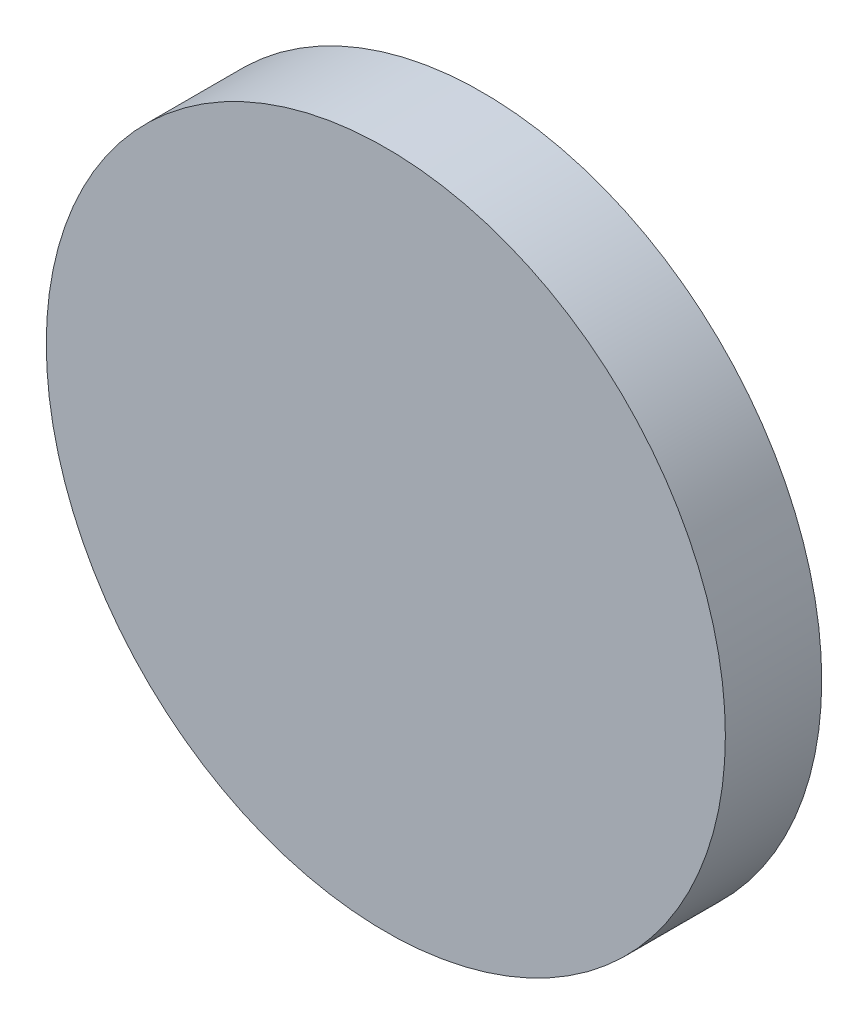
ISO-10303-21;
HEADER;
FILE_DESCRIPTION(('STEP AP214'),'2;1');
FILE_NAME('part.step','',(''),(''),'','','');
FILE_SCHEMA(('AUTOMOTIVE_DESIGN { 1 0 10303 214 1 1 1 1 }'));
ENDSEC;
DATA;
#1=APPLICATION_CONTEXT('core data for automotive mechanical design processes');
#2=APPLICATION_PROTOCOL_DEFINITION('international standard','automotive_design',2000,#1);
#3=PRODUCT_CONTEXT('',#1,'mechanical');
#4=PRODUCT('Part','Part','',(#3));
#5=PRODUCT_RELATED_PRODUCT_CATEGORY('part','',(#4));
#6=PRODUCT_DEFINITION_FORMATION('','',#4);
#7=PRODUCT_DEFINITION_CONTEXT('part definition',#1,'design');
#8=PRODUCT_DEFINITION('design','',#6,#7);
#9=PRODUCT_DEFINITION_SHAPE('','',#8);
#10=(LENGTH_UNIT() NAMED_UNIT(*) SI_UNIT(.MILLI.,.METRE.));
#11=(NAMED_UNIT(*) PLANE_ANGLE_UNIT() SI_UNIT($,.RADIAN.));
#12=(NAMED_UNIT(*) SI_UNIT($,.STERADIAN.) SOLID_ANGLE_UNIT());
#13=UNCERTAINTY_MEASURE_WITH_UNIT(LENGTH_MEASURE(1.E-05),#10,'distance_accuracy_value','');
#14=(GEOMETRIC_REPRESENTATION_CONTEXT(3) GLOBAL_UNCERTAINTY_ASSIGNED_CONTEXT((#13)) GLOBAL_UNIT_ASSIGNED_CONTEXT((#10,
#11,#12)) REPRESENTATION_CONTEXT('',''));
#15=CARTESIAN_POINT('',(0.,0.,0.));
#16=DIRECTION('',(0.,0.,1.));
#17=DIRECTION('',(1.,0.,0.));
#18=AXIS2_PLACEMENT_3D('',#15,#16,#17);
#19=CARTESIAN_POINT('',(0.,0.,2.59695236331892));
#20=DIRECTION('',(0.,0.,-1.));
#21=DIRECTION('',(-1.,0.,0.));
#22=AXIS2_PLACEMENT_3D('',#19,#20,#21);
#23=PLANE('',#22);
#24=CARTESIAN_POINT('',(0.,0.,2.59695236331892));
#25=DIRECTION('',(0.,0.,1.));
#26=DIRECTION('',(1.,0.,0.));
#27=AXIS2_PLACEMENT_3D('',#24,#25,#26);
#28=CIRCLE('',#27,136.52);
#29=CARTESIAN_POINT('',(136.52,0.,2.59695236331892));
#30=VERTEX_POINT('',#29);
#31=EDGE_CURVE('E10',#30,#30,#28,.T.);
#32=ORIENTED_EDGE('',*,*,#31,.T.);
#33=EDGE_LOOP('',(#32));
#34=FACE_BOUND('',#33,.T.);
#35=ADVANCED_FACE('F39',(#34),#23,.F.);
#36=CARTESIAN_POINT('',(0.,0.,53.8354538311833));
#37=DIRECTION('',(0.,0.,1.));
#38=DIRECTION('',(1.,0.,0.));
#39=AXIS2_PLACEMENT_3D('',#36,#37,#38);
#40=CYLINDRICAL_SURFACE('',#39,136.52);
#41=ORIENTED_EDGE('',*,*,#31,.F.);
#42=EDGE_LOOP('',(#41));
#43=FACE_BOUND('',#42,.T.);
#44=CARTESIAN_POINT('',(0.,0.,-36.1451883377251));
#45=DIRECTION('',(0.,0.,1.));
#46=DIRECTION('',(1.,0.,0.));
#47=AXIS2_PLACEMENT_3D('',#44,#45,#46);
#48=CIRCLE('',#47,136.52);
#49=CARTESIAN_POINT('',(136.52,0.,-36.1451883377251));
#50=VERTEX_POINT('',#49);
#51=EDGE_CURVE('E46',#50,#50,#48,.T.);
#52=ORIENTED_EDGE('',*,*,#51,.T.);
#53=EDGE_LOOP('',(#52));
#54=FACE_BOUND('',#53,.T.);
#55=ADVANCED_FACE('F107',(#43,#54),#40,.T.);
#56=CARTESIAN_POINT('',(0.,136.52,-36.1451883377251));
#57=DIRECTION('',(0.,0.,1.));
#58=DIRECTION('',(1.,0.,0.));
#59=AXIS2_PLACEMENT_3D('',#56,#57,#58);
#60=PLANE('',#59);
#61=ORIENTED_EDGE('',*,*,#51,.F.);
#62=EDGE_LOOP('',(#61));
#63=FACE_BOUND('',#62,.T.);
#64=CARTESIAN_POINT('',(0.,0.,-36.1451883377251));
#65=DIRECTION('',(0.,0.,1.));
#66=DIRECTION('',(1.,0.,0.));
#67=AXIS2_PLACEMENT_3D('',#64,#65,#66);
#68=CIRCLE('',#67,133.52);
#69=CARTESIAN_POINT('',(133.52,0.,-36.1451883377251));
#70=VERTEX_POINT('',#69);
#71=EDGE_CURVE('E51',#70,#70,#68,.T.);
#72=ORIENTED_EDGE('',*,*,#71,.T.);
#73=EDGE_LOOP('',(#72));
#74=FACE_BOUND('',#73,.T.);
#75=ADVANCED_FACE('F111',(#63,#74),#60,.F.);
#76=CARTESIAN_POINT('',(0.,0.,53.8354538311833));
#77=DIRECTION('',(0.,0.,1.));
#78=DIRECTION('',(1.,0.,0.));
#79=AXIS2_PLACEMENT_3D('',#76,#77,#78);
#80=CYLINDRICAL_SURFACE('',#79,133.52);
#81=ORIENTED_EDGE('',*,*,#71,.F.);
#82=EDGE_LOOP('',(#81));
#83=FACE_BOUND('',#82,.T.);
#84=CARTESIAN_POINT('',(0.,0.,-1.14518833772513));
#85=DIRECTION('',(0.,0.,1.));
#86=DIRECTION('',(1.,0.,0.));
#87=AXIS2_PLACEMENT_3D('',#84,#85,#86);
#88=CIRCLE('',#87,133.52);
#89=CARTESIAN_POINT('',(133.52,0.,-1.14518833772513));
#90=VERTEX_POINT('',#89);
#91=EDGE_CURVE('E56',#90,#90,#88,.T.);
#92=ORIENTED_EDGE('',*,*,#91,.T.);
#93=EDGE_LOOP('',(#92));
#94=FACE_BOUND('',#93,.T.);
#95=ADVANCED_FACE('F116',(#83,#94),#80,.F.);
#96=CARTESIAN_POINT('',(0.,133.52,-1.14518833772513));
#97=DIRECTION('',(0.,0.,1.));
#98=DIRECTION('',(1.,0.,0.));
#99=AXIS2_PLACEMENT_3D('',#96,#97,#98);
#100=PLANE('',#99);
#101=ORIENTED_EDGE('',*,*,#91,.F.);
#102=EDGE_LOOP('',(#101));
#103=FACE_BOUND('',#102,.T.);
#104=CARTESIAN_POINT('',(0.,0.,-1.14518833772514));
#105=DIRECTION('',(0.,0.,1.));
#106=DIRECTION('',(1.,0.,0.));
#107=AXIS2_PLACEMENT_3D('',#104,#105,#106);
#108=CIRCLE('',#107,98.);
#109=CARTESIAN_POINT('',(98.,0.,-1.14518833772514));
#110=VERTEX_POINT('',#109);
#111=EDGE_CURVE('E62',#110,#110,#108,.T.);
#112=ORIENTED_EDGE('',*,*,#111,.T.);
#113=EDGE_LOOP('',(#112));
#114=FACE_BOUND('',#113,.T.);
#115=ADVANCED_FACE('F122',(#103,#114),#100,.F.);
#116=CARTESIAN_POINT('',(0.,0.,53.8354538311833));
#117=DIRECTION('',(0.,0.,1.));
#118=DIRECTION('',(1.,0.,0.));
#119=AXIS2_PLACEMENT_3D('',#116,#117,#118);
#120=CYLINDRICAL_SURFACE('',#119,98.);
#121=ORIENTED_EDGE('',*,*,#111,.F.);
#122=EDGE_LOOP('',(#121));
#123=FACE_BOUND('',#122,.T.);
#124=CARTESIAN_POINT('',(0.,0.,-36.1451883377251));
#125=DIRECTION('',(0.,0.,1.));
#126=DIRECTION('',(1.,0.,0.));
#127=AXIS2_PLACEMENT_3D('',#124,#125,#126);
#128=CIRCLE('',#127,98.);
#129=CARTESIAN_POINT('',(98.,0.,-36.1451883377251));
#130=VERTEX_POINT('',#129);
#131=EDGE_CURVE('E66',#130,#130,#128,.T.);
#132=ORIENTED_EDGE('',*,*,#131,.T.);
#133=EDGE_LOOP('',(#132));
#134=FACE_BOUND('',#133,.T.);
#135=ADVANCED_FACE('F126',(#123,#134),#120,.T.);
#136=CARTESIAN_POINT('',(0.,98.,-36.1451883377251));
#137=DIRECTION('',(0.,0.,1.));
#138=DIRECTION('',(1.,0.,0.));
#139=AXIS2_PLACEMENT_3D('',#136,#137,#138);
#140=PLANE('',#139);
#141=ORIENTED_EDGE('',*,*,#131,.F.);
#142=EDGE_LOOP('',(#141));
#143=FACE_BOUND('',#142,.T.);
#144=CARTESIAN_POINT('',(0.,0.,-36.1451883377251));
#145=DIRECTION('',(0.,0.,1.));
#146=DIRECTION('',(1.,0.,0.));
#147=AXIS2_PLACEMENT_3D('',#144,#145,#146);
#148=CIRCLE('',#147,95.);
#149=CARTESIAN_POINT('',(95.,0.,-36.1451883377251));
#150=VERTEX_POINT('',#149);
#151=EDGE_CURVE('E70',#150,#150,#148,.T.);
#152=ORIENTED_EDGE('',*,*,#151,.T.);
#153=EDGE_LOOP('',(#152));
#154=FACE_BOUND('',#153,.T.);
#155=ADVANCED_FACE('F130',(#143,#154),#140,.F.);
#156=CARTESIAN_POINT('',(0.,0.,53.8354538311833));
#157=DIRECTION('',(0.,0.,1.));
#158=DIRECTION('',(1.,0.,0.));
#159=AXIS2_PLACEMENT_3D('',#156,#157,#158);
#160=CYLINDRICAL_SURFACE('',#159,95.);
#161=ORIENTED_EDGE('',*,*,#151,.F.);
#162=EDGE_LOOP('',(#161));
#163=FACE_BOUND('',#162,.T.);
#164=CARTESIAN_POINT('',(0.,0.,-29.483104668401));
#165=DIRECTION('',(0.,0.,1.));
#166=DIRECTION('',(1.,0.,0.));
#167=AXIS2_PLACEMENT_3D('',#164,#165,#166);
#168=CIRCLE('',#167,95.);
#169=CARTESIAN_POINT('',(95.,0.,-29.483104668401));
#170=VERTEX_POINT('',#169);
#171=EDGE_CURVE('E74',#170,#170,#168,.T.);
#172=ORIENTED_EDGE('',*,*,#171,.T.);
#173=EDGE_LOOP('',(#172));
#174=FACE_BOUND('',#173,.T.);
#175=ADVANCED_FACE('F134',(#163,#174),#160,.F.);
#176=CARTESIAN_POINT('',(0.,95.,-29.483104668401));
#177=DIRECTION('',(0.,0.,-1.));
#178=DIRECTION('',(-1.,0.,0.));
#179=AXIS2_PLACEMENT_3D('',#176,#177,#178);
#180=PLANE('',#179);
#181=ORIENTED_EDGE('',*,*,#171,.F.);
#182=EDGE_LOOP('',(#181));
#183=FACE_BOUND('',#182,.T.);
#184=CARTESIAN_POINT('',(0.,0.,-29.483104668401));
#185=DIRECTION('',(0.,0.,1.));
#186=DIRECTION('',(1.,0.,0.));
#187=AXIS2_PLACEMENT_3D('',#184,#185,#186);
#188=CIRCLE('',#187,96.2573908592782);
#189=CARTESIAN_POINT('',(96.2573908592782,0.,-29.483104668401));
#190=VERTEX_POINT('',#189);
#191=EDGE_CURVE('E78',#190,#190,#188,.T.);
#192=ORIENTED_EDGE('',*,*,#191,.T.);
#193=EDGE_LOOP('',(#192));
#194=FACE_BOUND('',#193,.T.);
#195=ADVANCED_FACE('F138',(#183,#194),#180,.F.);
#196=CARTESIAN_POINT('',(0.,0.,53.8354538311833));
#197=DIRECTION('',(0.,0.,1.));
#198=DIRECTION('',(1.,0.,0.));
#199=AXIS2_PLACEMENT_3D('',#196,#197,#198);
#200=CYLINDRICAL_SURFACE('',#199,96.2573908592782);
#201=ORIENTED_EDGE('',*,*,#191,.F.);
#202=EDGE_LOOP('',(#201));
#203=FACE_BOUND('',#202,.T.);
#204=CARTESIAN_POINT('',(0.,0.,-25.3729708818895));
#205=DIRECTION('',(0.,0.,1.));
#206=DIRECTION('',(1.,0.,0.));
#207=AXIS2_PLACEMENT_3D('',#204,#205,#206);
#208=CIRCLE('',#207,96.2573908592782);
#209=CARTESIAN_POINT('',(96.2573908592782,0.,-25.3729708818895));
#210=VERTEX_POINT('',#209);
#211=EDGE_CURVE('E82',#210,#210,#208,.T.);
#212=ORIENTED_EDGE('',*,*,#211,.T.);
#213=EDGE_LOOP('',(#212));
#214=FACE_BOUND('',#213,.T.);
#215=ADVANCED_FACE('F142',(#203,#214),#200,.F.);
#216=CARTESIAN_POINT('',(0.,95.,-25.3729708818895));
#217=DIRECTION('',(0.,0.,1.));
#218=DIRECTION('',(1.,0.,0.));
#219=AXIS2_PLACEMENT_3D('',#216,#217,#218);
#220=PLANE('',#219);
#221=ORIENTED_EDGE('',*,*,#211,.F.);
#222=EDGE_LOOP('',(#221));
#223=FACE_BOUND('',#222,.T.);
#224=CARTESIAN_POINT('',(0.,0.,-25.3729708818895));
#225=DIRECTION('',(0.,0.,1.));
#226=DIRECTION('',(1.,0.,0.));
#227=AXIS2_PLACEMENT_3D('',#224,#225,#226);
#228=CIRCLE('',#227,95.);
#229=CARTESIAN_POINT('',(95.,0.,-25.3729708818895));
#230=VERTEX_POINT('',#229);
#231=EDGE_CURVE('E86',#230,#230,#228,.T.);
#232=ORIENTED_EDGE('',*,*,#231,.T.);
#233=EDGE_LOOP('',(#232));
#234=FACE_BOUND('',#233,.T.);
#235=ADVANCED_FACE('F103',(#223,#234),#220,.F.);
#236=CARTESIAN_POINT('',(0.,0.,53.8354538311833));
#237=DIRECTION('',(0.,0.,1.));
#238=DIRECTION('',(1.,0.,0.));
#239=AXIS2_PLACEMENT_3D('',#236,#237,#238);
#240=CYLINDRICAL_SURFACE('',#239,95.);
#241=ORIENTED_EDGE('',*,*,#231,.F.);
#242=EDGE_LOOP('',(#241));
#243=FACE_BOUND('',#242,.T.);
#244=CARTESIAN_POINT('',(0.,0.,-0.403047636681073));
#245=DIRECTION('',(0.,0.,1.));
#246=DIRECTION('',(1.,0.,0.));
#247=AXIS2_PLACEMENT_3D('',#244,#245,#246);
#248=CIRCLE('',#247,95.);
#249=CARTESIAN_POINT('',(95.,0.,-0.403047636681073));
#250=VERTEX_POINT('',#249);
#251=EDGE_CURVE('E90',#250,#250,#248,.T.);
#252=ORIENTED_EDGE('',*,*,#251,.T.);
#253=EDGE_LOOP('',(#252));
#254=FACE_BOUND('',#253,.T.);
#255=ADVANCED_FACE('F95',(#243,#254),#240,.F.);
#256=CARTESIAN_POINT('',(0.,95.,-0.403047636681078));
#257=DIRECTION('',(0.,0.,1.));
#258=DIRECTION('',(1.,0.,0.));
#259=AXIS2_PLACEMENT_3D('',#256,#257,#258);
#260=PLANE('',#259);
#261=ORIENTED_EDGE('',*,*,#251,.F.);
#262=EDGE_LOOP('',(#261));
#263=FACE_BOUND('',#262,.T.);
#264=ADVANCED_FACE('F97',(#263),#260,.F.);
#265=CLOSED_SHELL('',(#35,#55,#75,#95,#115,#135,#155,#175,#195,#215,#235,#255,#264));
#266=MANIFOLD_SOLID_BREP('B2',#265);
#267=ADVANCED_BREP_SHAPE_REPRESENTATION('',(#18,#266),#14);
#268=SHAPE_DEFINITION_REPRESENTATION(#9,#267);
ENDSEC;
END-ISO-10303-21;
